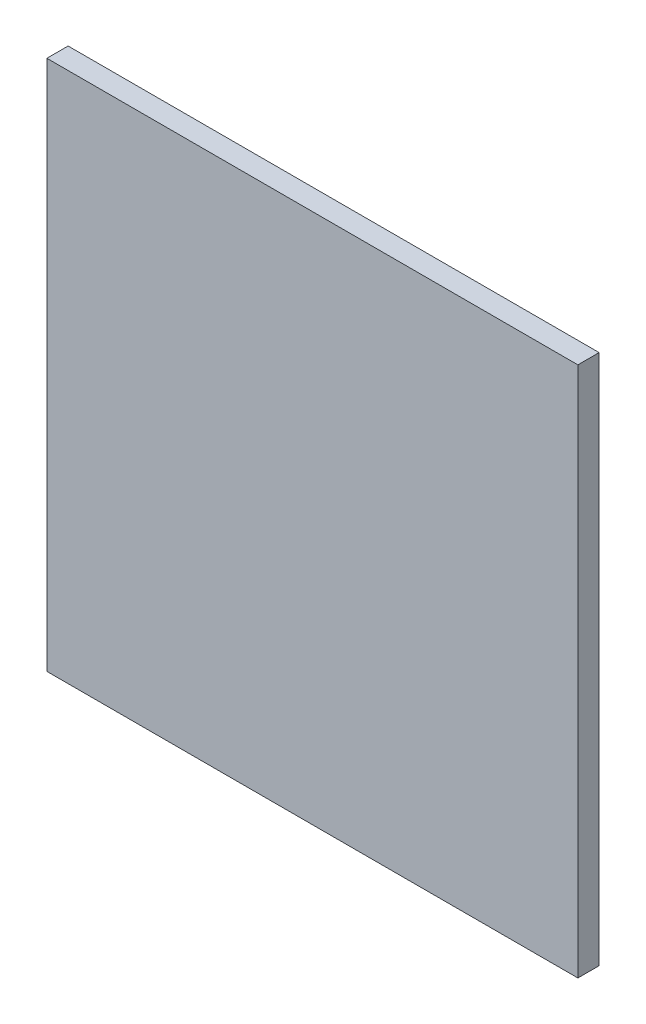
ISO-10303-21;
HEADER;
FILE_DESCRIPTION(('STEP AP214'),'2;1');
FILE_NAME('part.step','',(''),(''),'','','');
FILE_SCHEMA(('AUTOMOTIVE_DESIGN { 1 0 10303 214 1 1 1 1 }'));
ENDSEC;
DATA;
#1=APPLICATION_CONTEXT('core data for automotive mechanical design processes');
#2=APPLICATION_PROTOCOL_DEFINITION('international standard','automotive_design',2000,#1);
#3=PRODUCT_CONTEXT('',#1,'mechanical');
#4=PRODUCT('Part','Part','',(#3));
#5=PRODUCT_RELATED_PRODUCT_CATEGORY('part','',(#4));
#6=PRODUCT_DEFINITION_FORMATION('','',#4);
#7=PRODUCT_DEFINITION_CONTEXT('part definition',#1,'design');
#8=PRODUCT_DEFINITION('design','',#6,#7);
#9=PRODUCT_DEFINITION_SHAPE('','',#8);
#10=(LENGTH_UNIT() NAMED_UNIT(*) SI_UNIT(.MILLI.,.METRE.));
#11=(NAMED_UNIT(*) PLANE_ANGLE_UNIT() SI_UNIT($,.RADIAN.));
#12=(NAMED_UNIT(*) SI_UNIT($,.STERADIAN.) SOLID_ANGLE_UNIT());
#13=UNCERTAINTY_MEASURE_WITH_UNIT(LENGTH_MEASURE(1.E-05),#10,'distance_accuracy_value','');
#14=(GEOMETRIC_REPRESENTATION_CONTEXT(3) GLOBAL_UNCERTAINTY_ASSIGNED_CONTEXT((#13)) GLOBAL_UNIT_ASSIGNED_CONTEXT((#10,
#11,#12)) REPRESENTATION_CONTEXT('',''));
#15=CARTESIAN_POINT('',(0.,0.,0.));
#16=DIRECTION('',(0.,0.,1.));
#17=DIRECTION('',(1.,0.,0.));
#18=AXIS2_PLACEMENT_3D('',#15,#16,#17);
#19=CARTESIAN_POINT('',(12.5,12.5,1.));
#20=DIRECTION('',(-1.,0.,0.));
#21=DIRECTION('',(0.,-1.,0.));
#22=AXIS2_PLACEMENT_3D('',#19,#20,#21);
#23=PLANE('',#22);
#24=DIRECTION('',(0.,1.,0.));
#25=VECTOR('',#24,1.);
#26=CARTESIAN_POINT('',(12.5,12.5,0.));
#27=LINE('',#26,#25);
#28=CARTESIAN_POINT('',(12.5,-12.5,0.));
#29=VERTEX_POINT('',#28);
#30=CARTESIAN_POINT('',(12.5,12.5,0.));
#31=VERTEX_POINT('',#30);
#32=EDGE_CURVE('E107',#29,#31,#27,.T.);
#33=ORIENTED_EDGE('',*,*,#32,.T.);
#34=DIRECTION('',(0.,0.,-1.));
#35=VECTOR('',#34,1.);
#36=CARTESIAN_POINT('',(12.5,12.5,1.));
#37=LINE('',#36,#35);
#38=CARTESIAN_POINT('',(12.5,12.5,1.));
#39=VERTEX_POINT('',#38);
#40=EDGE_CURVE('E11',#39,#31,#37,.T.);
#41=ORIENTED_EDGE('',*,*,#40,.F.);
#42=DIRECTION('',(0.,1.,0.));
#43=VECTOR('',#42,1.);
#44=CARTESIAN_POINT('',(12.5,12.5,1.));
#45=LINE('',#44,#43);
#46=CARTESIAN_POINT('',(12.5,-12.5,1.));
#47=VERTEX_POINT('',#46);
#48=EDGE_CURVE('E91',#47,#39,#45,.T.);
#49=ORIENTED_EDGE('',*,*,#48,.F.);
#50=DIRECTION('',(0.,0.,-1.));
#51=VECTOR('',#50,1.);
#52=CARTESIAN_POINT('',(12.5,-12.5,1.));
#53=LINE('',#52,#51);
#54=EDGE_CURVE('E103',#47,#29,#53,.T.);
#55=ORIENTED_EDGE('',*,*,#54,.T.);
#56=EDGE_LOOP('',(#33,#41,#49,#55));
#57=FACE_BOUND('',#56,.T.);
#58=ADVANCED_FACE('F39',(#57),#23,.F.);
#59=CARTESIAN_POINT('',(-12.5,12.5,1.));
#60=DIRECTION('',(0.,-1.,0.));
#61=DIRECTION('',(0.,0.,-1.));
#62=AXIS2_PLACEMENT_3D('',#59,#60,#61);
#63=PLANE('',#62);
#64=DIRECTION('',(-1.,0.,0.));
#65=VECTOR('',#64,1.);
#66=CARTESIAN_POINT('',(-12.5,12.5,0.));
#67=LINE('',#66,#65);
#68=CARTESIAN_POINT('',(-12.5,12.5,0.));
#69=VERTEX_POINT('',#68);
#70=EDGE_CURVE('E96',#31,#69,#67,.T.);
#71=ORIENTED_EDGE('',*,*,#70,.T.);
#72=DIRECTION('',(0.,0.,-1.));
#73=VECTOR('',#72,1.);
#74=CARTESIAN_POINT('',(-12.5,12.5,1.));
#75=LINE('',#74,#73);
#76=CARTESIAN_POINT('',(-12.5,12.5,1.));
#77=VERTEX_POINT('',#76);
#78=EDGE_CURVE('E48',#77,#69,#75,.T.);
#79=ORIENTED_EDGE('',*,*,#78,.F.);
#80=DIRECTION('',(-1.,0.,0.));
#81=VECTOR('',#80,1.);
#82=CARTESIAN_POINT('',(-12.5,12.5,1.));
#83=LINE('',#82,#81);
#84=EDGE_CURVE('E86',#39,#77,#83,.T.);
#85=ORIENTED_EDGE('',*,*,#84,.F.);
#86=ORIENTED_EDGE('',*,*,#40,.T.);
#87=EDGE_LOOP('',(#71,#79,#85,#86));
#88=FACE_BOUND('',#87,.T.);
#89=ADVANCED_FACE('F95',(#88),#63,.F.);
#90=CARTESIAN_POINT('',(-12.5,12.5,1.));
#91=DIRECTION('',(1.,0.,0.));
#92=DIRECTION('',(0.,1.,0.));
#93=AXIS2_PLACEMENT_3D('',#90,#91,#92);
#94=PLANE('',#93);
#95=DIRECTION('',(0.,-1.,0.));
#96=VECTOR('',#95,1.);
#97=CARTESIAN_POINT('',(-12.5,12.5,0.));
#98=LINE('',#97,#96);
#99=CARTESIAN_POINT('',(-12.5,-12.5,0.));
#100=VERTEX_POINT('',#99);
#101=EDGE_CURVE('E73',#69,#100,#98,.T.);
#102=ORIENTED_EDGE('',*,*,#101,.T.);
#103=DIRECTION('',(0.,0.,-1.));
#104=VECTOR('',#103,1.);
#105=CARTESIAN_POINT('',(-12.5,-12.5,1.));
#106=LINE('',#105,#104);
#107=CARTESIAN_POINT('',(-12.5,-12.5,1.));
#108=VERTEX_POINT('',#107);
#109=EDGE_CURVE('E98',#108,#100,#106,.T.);
#110=ORIENTED_EDGE('',*,*,#109,.F.);
#111=DIRECTION('',(0.,-1.,0.));
#112=VECTOR('',#111,1.);
#113=CARTESIAN_POINT('',(-12.5,12.5,1.));
#114=LINE('',#113,#112);
#115=EDGE_CURVE('E89',#77,#108,#114,.T.);
#116=ORIENTED_EDGE('',*,*,#115,.F.);
#117=ORIENTED_EDGE('',*,*,#78,.T.);
#118=EDGE_LOOP('',(#102,#110,#116,#117));
#119=FACE_BOUND('',#118,.T.);
#120=ADVANCED_FACE('F99',(#119),#94,.F.);
#121=CARTESIAN_POINT('',(-12.5,-12.5,1.));
#122=DIRECTION('',(0.,1.,0.));
#123=DIRECTION('',(0.,0.,1.));
#124=AXIS2_PLACEMENT_3D('',#121,#122,#123);
#125=PLANE('',#124);
#126=DIRECTION('',(1.,0.,0.));
#127=VECTOR('',#126,1.);
#128=CARTESIAN_POINT('',(-12.5,-12.5,0.));
#129=LINE('',#128,#127);
#130=EDGE_CURVE('E79',#100,#29,#129,.T.);
#131=ORIENTED_EDGE('',*,*,#130,.T.);
#132=ORIENTED_EDGE('',*,*,#54,.F.);
#133=DIRECTION('',(1.,0.,0.));
#134=VECTOR('',#133,1.);
#135=CARTESIAN_POINT('',(-12.5,-12.5,1.));
#136=LINE('',#135,#134);
#137=EDGE_CURVE('E56',#108,#47,#136,.T.);
#138=ORIENTED_EDGE('',*,*,#137,.F.);
#139=ORIENTED_EDGE('',*,*,#109,.T.);
#140=EDGE_LOOP('',(#131,#132,#138,#139));
#141=FACE_BOUND('',#140,.T.);
#142=ADVANCED_FACE('F120',(#141),#125,.F.);
#143=CARTESIAN_POINT('',(0.,0.,1.));
#144=DIRECTION('',(0.,0.,1.));
#145=DIRECTION('',(1.,0.,0.));
#146=AXIS2_PLACEMENT_3D('',#143,#144,#145);
#147=PLANE('',#146);
#148=ORIENTED_EDGE('',*,*,#48,.T.);
#149=ORIENTED_EDGE('',*,*,#84,.T.);
#150=ORIENTED_EDGE('',*,*,#115,.T.);
#151=ORIENTED_EDGE('',*,*,#137,.T.);
#152=EDGE_LOOP('',(#148,#149,#150,#151));
#153=FACE_BOUND('',#152,.T.);
#154=ADVANCED_FACE('F87',(#153),#147,.T.);
#155=CARTESIAN_POINT('',(0.,0.,0.));
#156=DIRECTION('',(0.,0.,1.));
#157=DIRECTION('',(1.,0.,0.));
#158=AXIS2_PLACEMENT_3D('',#155,#156,#157);
#159=PLANE('',#158);
#160=ORIENTED_EDGE('',*,*,#32,.F.);
#161=ORIENTED_EDGE('',*,*,#130,.F.);
#162=ORIENTED_EDGE('',*,*,#101,.F.);
#163=ORIENTED_EDGE('',*,*,#70,.F.);
#164=EDGE_LOOP('',(#160,#161,#162,#163));
#165=FACE_BOUND('',#164,.T.);
#166=ADVANCED_FACE('F123',(#165),#159,.F.);
#167=CLOSED_SHELL('',(#58,#89,#120,#142,#154,#166));
#168=MANIFOLD_SOLID_BREP('B2',#167);
#169=ADVANCED_BREP_SHAPE_REPRESENTATION('',(#18,#168),#14);
#170=SHAPE_DEFINITION_REPRESENTATION(#9,#169);
ENDSEC;
END-ISO-10303-21;
